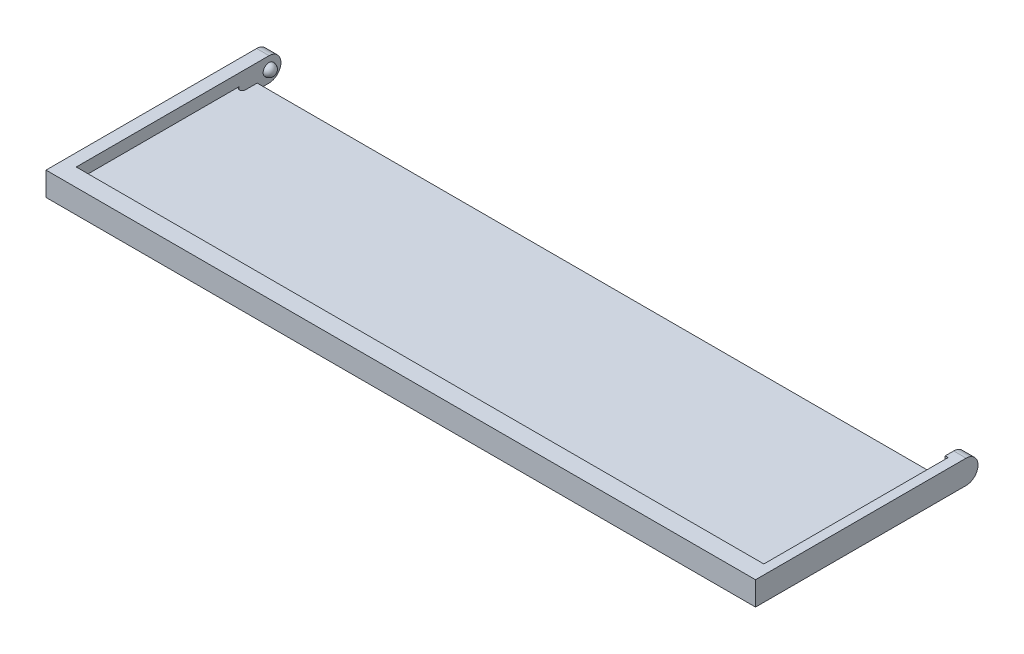
ISO-10303-21;
HEADER;
FILE_DESCRIPTION(('STEP AP214'),'2;1');
FILE_NAME('part.step','',(''),(''),'','','');
FILE_SCHEMA(('AUTOMOTIVE_DESIGN { 1 0 10303 214 1 1 1 1 }'));
ENDSEC;
DATA;
#1=APPLICATION_CONTEXT('core data for automotive mechanical design processes');
#2=APPLICATION_PROTOCOL_DEFINITION('international standard','automotive_design',2000,#1);
#3=PRODUCT_CONTEXT('',#1,'mechanical');
#4=PRODUCT('Part','Part','',(#3));
#5=PRODUCT_RELATED_PRODUCT_CATEGORY('part','',(#4));
#6=PRODUCT_DEFINITION_FORMATION('','',#4);
#7=PRODUCT_DEFINITION_CONTEXT('part definition',#1,'design');
#8=PRODUCT_DEFINITION('design','',#6,#7);
#9=PRODUCT_DEFINITION_SHAPE('','',#8);
#10=(LENGTH_UNIT() NAMED_UNIT(*) SI_UNIT(.MILLI.,.METRE.));
#11=(NAMED_UNIT(*) PLANE_ANGLE_UNIT() SI_UNIT($,.RADIAN.));
#12=(NAMED_UNIT(*) SI_UNIT($,.STERADIAN.) SOLID_ANGLE_UNIT());
#13=UNCERTAINTY_MEASURE_WITH_UNIT(LENGTH_MEASURE(1.E-05),#10,'distance_accuracy_value','');
#14=(GEOMETRIC_REPRESENTATION_CONTEXT(3) GLOBAL_UNCERTAINTY_ASSIGNED_CONTEXT((#13)) GLOBAL_UNIT_ASSIGNED_CONTEXT((#10,
#11,#12)) REPRESENTATION_CONTEXT('',''));
#15=CARTESIAN_POINT('',(0.,0.,0.));
#16=DIRECTION('',(0.,0.,1.));
#17=DIRECTION('',(1.,0.,0.));
#18=AXIS2_PLACEMENT_3D('',#15,#16,#17);
#19=CARTESIAN_POINT('',(49.31605633386,-6.,-26.0544436152008));
#20=DIRECTION('',(0.,1.,0.));
#21=DIRECTION('',(0.,0.,1.));
#22=AXIS2_PLACEMENT_3D('',#19,#20,#21);
#23=CYLINDRICAL_SURFACE('',#22,0.500000000000004);
#24=CARTESIAN_POINT('',(49.31605633386,2.,-26.0544436152008));
#25=DIRECTION('',(0.,1.,0.));
#26=DIRECTION('',(0.,0.,1.));
#27=AXIS2_PLACEMENT_3D('',#24,#25,#26);
#28=CIRCLE('',#27,0.500000000000004);
#29=CARTESIAN_POINT('',(49.81605633386,2.,-26.0544436152008));
#30=VERTEX_POINT('',#29);
#31=CARTESIAN_POINT('',(48.81605633386,2.,-26.0544436152008));
#32=VERTEX_POINT('',#31);
#33=EDGE_CURVE('E224',#30,#32,#28,.F.);
#34=ORIENTED_EDGE('',*,*,#33,.F.);
#35=DIRECTION('',(0.,1.,0.));
#36=VECTOR('',#35,1.);
#37=CARTESIAN_POINT('',(49.81605633386,-6.,-26.0544436152008));
#38=LINE('',#37,#36);
#39=CARTESIAN_POINT('',(49.81605633386,0.,-26.0544436152008));
#40=VERTEX_POINT('',#39);
#41=EDGE_CURVE('E235',#40,#30,#38,.T.);
#42=ORIENTED_EDGE('',*,*,#41,.F.);
#43=CARTESIAN_POINT('',(49.31605633386,0.,-26.0544436152008));
#44=DIRECTION('',(0.,-1.,0.));
#45=DIRECTION('',(0.,0.,-1.));
#46=AXIS2_PLACEMENT_3D('',#43,#44,#45);
#47=CIRCLE('',#46,0.500000000000004);
#48=CARTESIAN_POINT('',(48.81605633386,0.,-26.0544436152008));
#49=VERTEX_POINT('',#48);
#50=EDGE_CURVE('E314',#40,#49,#47,.T.);
#51=ORIENTED_EDGE('',*,*,#50,.T.);
#52=DIRECTION('',(0.,1.,0.));
#53=VECTOR('',#52,1.);
#54=CARTESIAN_POINT('',(48.81605633386,-6.,-26.0544436152008));
#55=LINE('',#54,#53);
#56=EDGE_CURVE('E240',#49,#32,#55,.T.);
#57=ORIENTED_EDGE('',*,*,#56,.T.);
#58=EDGE_LOOP('',(#34,#42,#51,#57));
#59=FACE_BOUND('',#58,.T.);
#60=ADVANCED_FACE('F43',(#59),#23,.F.);
#61=CARTESIAN_POINT('',(48.81605633386,-6.,0.));
#62=DIRECTION('',(-1.,0.,0.));
#63=DIRECTION('',(0.,0.,1.));
#64=AXIS2_PLACEMENT_3D('',#61,#62,#63);
#65=PLANE('',#64);
#66=DIRECTION('',(0.,0.,-1.));
#67=VECTOR('',#66,1.);
#68=CARTESIAN_POINT('',(48.81605633386,2.,0.));
#69=LINE('',#68,#67);
#70=CARTESIAN_POINT('',(48.81605633386,2.,-28.0544436152008));
#71=VERTEX_POINT('',#70);
#72=EDGE_CURVE('E221',#32,#71,#69,.T.);
#73=ORIENTED_EDGE('',*,*,#72,.F.);
#74=ORIENTED_EDGE('',*,*,#56,.F.);
#75=DIRECTION('',(0.,0.,-1.));
#76=VECTOR('',#75,1.);
#77=CARTESIAN_POINT('',(48.81605633386,0.,0.));
#78=LINE('',#77,#76);
#79=CARTESIAN_POINT('',(48.81605633386,0.,-28.0544436152008));
#80=VERTEX_POINT('',#79);
#81=EDGE_CURVE('E311',#49,#80,#78,.T.);
#82=ORIENTED_EDGE('',*,*,#81,.T.);
#83=DIRECTION('',(0.,1.,0.));
#84=VECTOR('',#83,1.);
#85=CARTESIAN_POINT('',(48.81605633386,-6.,-28.0544436152008));
#86=LINE('',#85,#84);
#87=EDGE_CURVE('E244',#80,#71,#86,.T.);
#88=ORIENTED_EDGE('',*,*,#87,.T.);
#89=EDGE_LOOP('',(#73,#74,#82,#88));
#90=FACE_BOUND('',#89,.T.);
#91=ADVANCED_FACE('F386',(#90),#65,.F.);
#92=CARTESIAN_POINT('',(0.,-6.,-28.0544436152008));
#93=DIRECTION('',(0.,0.,1.));
#94=DIRECTION('',(1.,0.,0.));
#95=AXIS2_PLACEMENT_3D('',#92,#93,#94);
#96=PLANE('',#95);
#97=DIRECTION('',(-1.,0.,0.));
#98=VECTOR('',#97,1.);
#99=CARTESIAN_POINT('',(0.,2.,-28.0544436152008));
#100=LINE('',#99,#98);
#101=CARTESIAN_POINT('',(-64.58394366614,2.,-28.0544436152008));
#102=VERTEX_POINT('',#101);
#103=EDGE_CURVE('E218',#71,#102,#100,.T.);
#104=ORIENTED_EDGE('',*,*,#103,.F.);
#105=ORIENTED_EDGE('',*,*,#87,.F.);
#106=DIRECTION('',(-1.,0.,0.));
#107=VECTOR('',#106,1.);
#108=CARTESIAN_POINT('',(0.,0.,-28.0544436152008));
#109=LINE('',#108,#107);
#110=CARTESIAN_POINT('',(-64.58394366614,0.,-28.0544436152008));
#111=VERTEX_POINT('',#110);
#112=EDGE_CURVE('E308',#80,#111,#109,.T.);
#113=ORIENTED_EDGE('',*,*,#112,.T.);
#114=DIRECTION('',(0.,1.,0.));
#115=VECTOR('',#114,1.);
#116=CARTESIAN_POINT('',(-64.58394366614,-6.,-28.0544436152008));
#117=LINE('',#116,#115);
#118=EDGE_CURVE('E248',#111,#102,#117,.T.);
#119=ORIENTED_EDGE('',*,*,#118,.T.);
#120=EDGE_LOOP('',(#104,#105,#113,#119));
#121=FACE_BOUND('',#120,.T.);
#122=ADVANCED_FACE('F392',(#121),#96,.F.);
#123=CARTESIAN_POINT('',(-64.5839436661399,-6.,2.24070566497633E-13));
#124=DIRECTION('',(-1.,0.,0.));
#125=DIRECTION('',(0.,0.,1.));
#126=AXIS2_PLACEMENT_3D('',#123,#124,#125);
#127=PLANE('',#126);
#128=DIRECTION('',(0.,1.,0.));
#129=VECTOR('',#128,1.);
#130=CARTESIAN_POINT('',(-64.58394366614,-6.,-26.0544436152008));
#131=LINE('',#130,#129);
#132=CARTESIAN_POINT('',(-64.58394366614,0.,-26.0544436152008));
#133=VERTEX_POINT('',#132);
#134=CARTESIAN_POINT('',(-64.58394366614,2.,-26.0544436152008));
#135=VERTEX_POINT('',#134);
#136=EDGE_CURVE('E252',#133,#135,#131,.T.);
#137=ORIENTED_EDGE('',*,*,#136,.T.);
#138=DIRECTION('',(0.,0.,-1.));
#139=VECTOR('',#138,1.);
#140=CARTESIAN_POINT('',(-64.5839436661399,2.,2.24070566497633E-13));
#141=LINE('',#140,#139);
#142=EDGE_CURVE('E58',#135,#102,#141,.T.);
#143=ORIENTED_EDGE('',*,*,#142,.T.);
#144=ORIENTED_EDGE('',*,*,#118,.F.);
#145=DIRECTION('',(0.,0.,-1.));
#146=VECTOR('',#145,1.);
#147=CARTESIAN_POINT('',(-64.5839436661399,0.,2.24070566497633E-13));
#148=LINE('',#147,#146);
#149=EDGE_CURVE('E304',#133,#111,#148,.T.);
#150=ORIENTED_EDGE('',*,*,#149,.F.);
#151=EDGE_LOOP('',(#137,#143,#144,#150));
#152=FACE_BOUND('',#151,.T.);
#153=ADVANCED_FACE('F399',(#152),#127,.T.);
#154=CARTESIAN_POINT('',(-65.08394366614,-6.,-26.0544436152008));
#155=DIRECTION('',(0.,1.,0.));
#156=DIRECTION('',(0.,0.,1.));
#157=AXIS2_PLACEMENT_3D('',#154,#155,#156);
#158=CYLINDRICAL_SURFACE('',#157,0.500000000000007);
#159=CARTESIAN_POINT('',(-65.08394366614,2.,-26.0544436152008));
#160=DIRECTION('',(0.,1.,0.));
#161=DIRECTION('',(0.,0.,1.));
#162=AXIS2_PLACEMENT_3D('',#159,#160,#161);
#163=CIRCLE('',#162,0.500000000000007);
#164=CARTESIAN_POINT('',(-65.58394366614,2.,-26.0544436152008));
#165=VERTEX_POINT('',#164);
#166=EDGE_CURVE('E11',#135,#165,#163,.F.);
#167=ORIENTED_EDGE('',*,*,#166,.F.);
#168=ORIENTED_EDGE('',*,*,#136,.F.);
#169=CARTESIAN_POINT('',(-65.08394366614,0.,-26.0544436152008));
#170=DIRECTION('',(0.,-1.,0.));
#171=DIRECTION('',(0.,0.,-1.));
#172=AXIS2_PLACEMENT_3D('',#169,#170,#171);
#173=CIRCLE('',#172,0.500000000000007);
#174=CARTESIAN_POINT('',(-65.58394366614,0.,-26.0544436152008));
#175=VERTEX_POINT('',#174);
#176=EDGE_CURVE('E300',#133,#175,#173,.T.);
#177=ORIENTED_EDGE('',*,*,#176,.T.);
#178=DIRECTION('',(0.,1.,0.));
#179=VECTOR('',#178,1.);
#180=CARTESIAN_POINT('',(-65.58394366614,-6.,-26.0544436152008));
#181=LINE('',#180,#179);
#182=EDGE_CURVE('E256',#175,#165,#181,.T.);
#183=ORIENTED_EDGE('',*,*,#182,.T.);
#184=EDGE_LOOP('',(#167,#168,#177,#183));
#185=FACE_BOUND('',#184,.T.);
#186=ADVANCED_FACE('F403',(#185),#158,.F.);
#187=CARTESIAN_POINT('',(0.,4.,0.));
#188=DIRECTION('',(0.,-1.,0.));
#189=DIRECTION('',(0.,0.,-1.));
#190=AXIS2_PLACEMENT_3D('',#187,#188,#189);
#191=PLANE('',#190);
#192=DIRECTION('',(1.,0.,0.));
#193=VECTOR('',#192,1.);
#194=CARTESIAN_POINT('',(-65.58394366614,4.,1.44555638479922));
#195=LINE('',#194,#193);
#196=CARTESIAN_POINT('',(-65.58394366614,4.,1.44555638479922));
#197=VERTEX_POINT('',#196);
#198=CARTESIAN_POINT('',(50.31605633386,4.,1.44555638479922));
#199=VERTEX_POINT('',#198);
#200=EDGE_CURVE('E202',#197,#199,#195,.T.);
#201=ORIENTED_EDGE('',*,*,#200,.F.);
#202=DIRECTION('',(0.,0.,-1.));
#203=VECTOR('',#202,1.);
#204=CARTESIAN_POINT('',(-65.58394366614,4.,-30.0544436152008));
#205=LINE('',#204,#203);
#206=CARTESIAN_POINT('',(-65.58394366614,4.,-31.0544436152008));
#207=VERTEX_POINT('',#206);
#208=EDGE_CURVE('E183',#197,#207,#205,.T.);
#209=ORIENTED_EDGE('',*,*,#208,.T.);
#210=DIRECTION('',(-1.,0.,0.));
#211=VECTOR('',#210,1.);
#212=CARTESIAN_POINT('',(0.,4.,-31.0544436152008));
#213=LINE('',#212,#211);
#214=CARTESIAN_POINT('',(-67.68394366614,4.,-31.0544436152008));
#215=VERTEX_POINT('',#214);
#216=EDGE_CURVE('E340',#207,#215,#213,.T.);
#217=ORIENTED_EDGE('',*,*,#216,.T.);
#218=DIRECTION('',(0.,0.,1.));
#219=VECTOR('',#218,1.);
#220=CARTESIAN_POINT('',(-67.68394366614,4.,-30.0544436152008));
#221=LINE('',#220,#219);
#222=CARTESIAN_POINT('',(-67.68394366614,4.,4.44555638479922));
#223=VERTEX_POINT('',#222);
#224=EDGE_CURVE('E260',#215,#223,#221,.T.);
#225=ORIENTED_EDGE('',*,*,#224,.T.);
#226=DIRECTION('',(1.,0.,0.));
#227=VECTOR('',#226,1.);
#228=CARTESIAN_POINT('',(-67.68394366614,4.,4.44555638479922));
#229=LINE('',#228,#227);
#230=CARTESIAN_POINT('',(51.91605633386,4.,4.44555638479922));
#231=VERTEX_POINT('',#230);
#232=EDGE_CURVE('E263',#223,#231,#229,.T.);
#233=ORIENTED_EDGE('',*,*,#232,.T.);
#234=DIRECTION('',(0.,0.,-1.));
#235=VECTOR('',#234,1.);
#236=CARTESIAN_POINT('',(51.91605633386,4.,-30.0544436152008));
#237=LINE('',#236,#235);
#238=CARTESIAN_POINT('',(51.91605633386,4.,-31.0544436152008));
#239=VERTEX_POINT('',#238);
#240=EDGE_CURVE('E267',#231,#239,#237,.T.);
#241=ORIENTED_EDGE('',*,*,#240,.T.);
#242=DIRECTION('',(-1.,0.,0.));
#243=VECTOR('',#242,1.);
#244=CARTESIAN_POINT('',(0.,4.,-31.0544436152008));
#245=LINE('',#244,#243);
#246=CARTESIAN_POINT('',(49.81605633386,4.,-31.0544436152008));
#247=VERTEX_POINT('',#246);
#248=EDGE_CURVE('E337',#239,#247,#245,.T.);
#249=ORIENTED_EDGE('',*,*,#248,.T.);
#250=DIRECTION('',(0.,0.,1.));
#251=VECTOR('',#250,1.);
#252=CARTESIAN_POINT('',(49.81605633386,4.,-30.0544436152008));
#253=LINE('',#252,#251);
#254=CARTESIAN_POINT('',(49.81605633386,4.,-29.6257113306572));
#255=VERTEX_POINT('',#254);
#256=EDGE_CURVE('E271',#247,#255,#253,.T.);
#257=ORIENTED_EDGE('',*,*,#256,.T.);
#258=DIRECTION('',(-1.,0.,0.));
#259=VECTOR('',#258,1.);
#260=CARTESIAN_POINT('',(-65.58394366614,4.,-29.6257113306572));
#261=LINE('',#260,#259);
#262=CARTESIAN_POINT('',(50.31605633386,4.,-29.6257113306572));
#263=VERTEX_POINT('',#262);
#264=EDGE_CURVE('E177',#263,#255,#261,.T.);
#265=ORIENTED_EDGE('',*,*,#264,.F.);
#266=DIRECTION('',(0.,0.,-1.));
#267=VECTOR('',#266,1.);
#268=CARTESIAN_POINT('',(50.31605633386,4.,-29.6257113306572));
#269=LINE('',#268,#267);
#270=EDGE_CURVE('E205',#199,#263,#269,.T.);
#271=ORIENTED_EDGE('',*,*,#270,.F.);
#272=EDGE_LOOP('',(#201,#209,#217,#225,#233,#241,#249,#257,#265,#271));
#273=FACE_BOUND('',#272,.T.);
#274=ADVANCED_FACE('F407',(#273),#191,.F.);
#275=CARTESIAN_POINT('',(0.,0.,0.));
#276=DIRECTION('',(0.,-1.,0.));
#277=DIRECTION('',(0.,0.,-1.));
#278=AXIS2_PLACEMENT_3D('',#275,#276,#277);
#279=PLANE('',#278);
#280=DIRECTION('',(0.,0.,1.));
#281=VECTOR('',#280,1.);
#282=CARTESIAN_POINT('',(-67.68394366614,0.,-30.0544436152008));
#283=LINE('',#282,#281);
#284=CARTESIAN_POINT('',(-67.68394366614,0.,-31.0544436152008));
#285=VERTEX_POINT('',#284);
#286=CARTESIAN_POINT('',(-67.68394366614,0.,4.44555638479922));
#287=VERTEX_POINT('',#286);
#288=EDGE_CURVE('E239',#285,#287,#283,.T.);
#289=ORIENTED_EDGE('',*,*,#288,.F.);
#290=DIRECTION('',(-1.,0.,0.));
#291=VECTOR('',#290,1.);
#292=CARTESIAN_POINT('',(-65.58394366614,0.,-31.0544436152008));
#293=LINE('',#292,#291);
#294=CARTESIAN_POINT('',(-65.58394366614,0.,-31.0544436152008));
#295=VERTEX_POINT('',#294);
#296=EDGE_CURVE('E327',#285,#295,#293,.F.);
#297=ORIENTED_EDGE('',*,*,#296,.T.);
#298=DIRECTION('',(0.,0.,-1.));
#299=VECTOR('',#298,1.);
#300=CARTESIAN_POINT('',(-65.58394366614,0.,-30.0544436152008));
#301=LINE('',#300,#299);
#302=EDGE_CURVE('E264',#175,#295,#301,.T.);
#303=ORIENTED_EDGE('',*,*,#302,.F.);
#304=ORIENTED_EDGE('',*,*,#176,.F.);
#305=ORIENTED_EDGE('',*,*,#149,.T.);
#306=ORIENTED_EDGE('',*,*,#112,.F.);
#307=ORIENTED_EDGE('',*,*,#81,.F.);
#308=ORIENTED_EDGE('',*,*,#50,.F.);
#309=DIRECTION('',(0.,0.,1.));
#310=VECTOR('',#309,1.);
#311=CARTESIAN_POINT('',(49.81605633386,0.,-30.0544436152008));
#312=LINE('',#311,#310);
#313=CARTESIAN_POINT('',(49.81605633386,0.,-31.0544436152008));
#314=VERTEX_POINT('',#313);
#315=EDGE_CURVE('E287',#314,#40,#312,.T.);
#316=ORIENTED_EDGE('',*,*,#315,.F.);
#317=DIRECTION('',(-1.,0.,0.));
#318=VECTOR('',#317,1.);
#319=CARTESIAN_POINT('',(51.91605633386,0.,-31.0544436152008));
#320=LINE('',#319,#318);
#321=CARTESIAN_POINT('',(51.91605633386,0.,-31.0544436152008));
#322=VERTEX_POINT('',#321);
#323=EDGE_CURVE('E323',#314,#322,#320,.F.);
#324=ORIENTED_EDGE('',*,*,#323,.T.);
#325=DIRECTION('',(0.,0.,-1.));
#326=VECTOR('',#325,1.);
#327=CARTESIAN_POINT('',(51.91605633386,0.,-30.0544436152008));
#328=LINE('',#327,#326);
#329=CARTESIAN_POINT('',(51.91605633386,0.,4.44555638479922));
#330=VERTEX_POINT('',#329);
#331=EDGE_CURVE('E284',#330,#322,#328,.T.);
#332=ORIENTED_EDGE('',*,*,#331,.F.);
#333=DIRECTION('',(1.,0.,0.));
#334=VECTOR('',#333,1.);
#335=CARTESIAN_POINT('',(-67.68394366614,0.,4.44555638479922));
#336=LINE('',#335,#334);
#337=EDGE_CURVE('E280',#287,#330,#336,.T.);
#338=ORIENTED_EDGE('',*,*,#337,.F.);
#339=EDGE_LOOP('',(#289,#297,#303,#304,#305,#306,#307,#308,#316,#324,#332,#338));
#340=FACE_BOUND('',#339,.T.);
#341=ADVANCED_FACE('F411',(#340),#279,.T.);
#342=CARTESIAN_POINT('',(-67.68394366614,4.,-30.0544436152008));
#343=DIRECTION('',(1.,0.,0.));
#344=DIRECTION('',(0.,0.,-1.));
#345=AXIS2_PLACEMENT_3D('',#342,#343,#344);
#346=PLANE('',#345);
#347=CARTESIAN_POINT('',(-67.68394366614,2.,-31.0544436152008));
#348=DIRECTION('',(1.,0.,0.));
#349=DIRECTION('',(0.,0.,-1.));
#350=AXIS2_PLACEMENT_3D('',#347,#348,#349);
#351=CIRCLE('',#350,2.);
#352=CARTESIAN_POINT('',(-67.68394366614,2.,-33.0544436152008));
#353=VERTEX_POINT('',#352);
#354=EDGE_CURVE('E317',#215,#353,#351,.F.);
#355=ORIENTED_EDGE('',*,*,#354,.T.);
#356=CARTESIAN_POINT('',(-67.68394366614,2.,-31.0544436152008));
#357=DIRECTION('',(1.,0.,0.));
#358=DIRECTION('',(0.,0.,-1.));
#359=AXIS2_PLACEMENT_3D('',#356,#357,#358);
#360=CIRCLE('',#359,2.);
#361=EDGE_CURVE('E320',#353,#285,#360,.F.);
#362=ORIENTED_EDGE('',*,*,#361,.T.);
#363=ORIENTED_EDGE('',*,*,#288,.T.);
#364=DIRECTION('',(0.,-1.,0.));
#365=VECTOR('',#364,1.);
#366=CARTESIAN_POINT('',(-67.68394366614,4.,4.44555638479922));
#367=LINE('',#366,#365);
#368=EDGE_CURVE('E296',#223,#287,#367,.T.);
#369=ORIENTED_EDGE('',*,*,#368,.F.);
#370=ORIENTED_EDGE('',*,*,#224,.F.);
#371=EDGE_LOOP('',(#355,#362,#363,#369,#370));
#372=FACE_BOUND('',#371,.T.);
#373=ADVANCED_FACE('F415',(#372),#346,.F.);
#374=CARTESIAN_POINT('',(-67.68394366614,4.,4.44555638479922));
#375=DIRECTION('',(0.,0.,-1.));
#376=DIRECTION('',(-1.,0.,0.));
#377=AXIS2_PLACEMENT_3D('',#374,#375,#376);
#378=PLANE('',#377);
#379=ORIENTED_EDGE('',*,*,#337,.T.);
#380=DIRECTION('',(0.,-1.,0.));
#381=VECTOR('',#380,1.);
#382=CARTESIAN_POINT('',(51.91605633386,4.,4.44555638479922));
#383=LINE('',#382,#381);
#384=EDGE_CURVE('E277',#231,#330,#383,.T.);
#385=ORIENTED_EDGE('',*,*,#384,.F.);
#386=ORIENTED_EDGE('',*,*,#232,.F.);
#387=ORIENTED_EDGE('',*,*,#368,.T.);
#388=EDGE_LOOP('',(#379,#385,#386,#387));
#389=FACE_BOUND('',#388,.T.);
#390=ADVANCED_FACE('F426',(#389),#378,.F.);
#391=CARTESIAN_POINT('',(51.91605633386,4.,-30.0544436152008));
#392=DIRECTION('',(-1.,0.,0.));
#393=DIRECTION('',(0.,0.,1.));
#394=AXIS2_PLACEMENT_3D('',#391,#392,#393);
#395=PLANE('',#394);
#396=ORIENTED_EDGE('',*,*,#331,.T.);
#397=CARTESIAN_POINT('',(51.91605633386,2.,-31.0544436152008));
#398=DIRECTION('',(-1.,0.,0.));
#399=DIRECTION('',(0.,0.,1.));
#400=AXIS2_PLACEMENT_3D('',#397,#398,#399);
#401=CIRCLE('',#400,2.);
#402=CARTESIAN_POINT('',(51.91605633386,2.,-33.0544436152008));
#403=VERTEX_POINT('',#402);
#404=EDGE_CURVE('E66',#322,#403,#401,.F.);
#405=ORIENTED_EDGE('',*,*,#404,.T.);
#406=CARTESIAN_POINT('',(51.91605633386,2.,-31.0544436152008));
#407=DIRECTION('',(-1.,0.,0.));
#408=DIRECTION('',(0.,0.,1.));
#409=AXIS2_PLACEMENT_3D('',#406,#407,#408);
#410=CIRCLE('',#409,2.);
#411=EDGE_CURVE('E349',#403,#239,#410,.F.);
#412=ORIENTED_EDGE('',*,*,#411,.T.);
#413=ORIENTED_EDGE('',*,*,#240,.F.);
#414=ORIENTED_EDGE('',*,*,#384,.T.);
#415=EDGE_LOOP('',(#396,#405,#412,#413,#414));
#416=FACE_BOUND('',#415,.T.);
#417=ADVANCED_FACE('F423',(#416),#395,.F.);
#418=CARTESIAN_POINT('',(49.81605633386,4.,-30.0544436152008));
#419=DIRECTION('',(1.,0.,0.));
#420=DIRECTION('',(0.,0.,-1.));
#421=AXIS2_PLACEMENT_3D('',#418,#419,#420);
#422=PLANE('',#421);
#423=CARTESIAN_POINT('',(49.81605633386,2.,-31.0544436152008));
#424=DIRECTION('',(1.,0.,0.));
#425=DIRECTION('',(0.,0.,-1.));
#426=AXIS2_PLACEMENT_3D('',#423,#424,#425);
#427=CIRCLE('',#426,1.);
#428=CARTESIAN_POINT('',(49.81605633386,2.,-32.0544436152008));
#429=VERTEX_POINT('',#428);
#430=EDGE_CURVE('E234',#429,#429,#427,.T.);
#431=ORIENTED_EDGE('',*,*,#430,.T.);
#432=EDGE_LOOP('',(#431));
#433=FACE_BOUND('',#432,.T.);
#434=DIRECTION('',(0.,0.,1.));
#435=VECTOR('',#434,1.);
#436=CARTESIAN_POINT('',(49.81605633386,2.,-30.0544436152008));
#437=LINE('',#436,#435);
#438=CARTESIAN_POINT('',(49.81605633386,2.,-29.6257113306572));
#439=VERTEX_POINT('',#438);
#440=EDGE_CURVE('E227',#439,#30,#437,.T.);
#441=ORIENTED_EDGE('',*,*,#440,.F.);
#442=DIRECTION('',(0.,1.,0.));
#443=VECTOR('',#442,1.);
#444=CARTESIAN_POINT('',(49.81605633386,4.,-29.6257113306572));
#445=LINE('',#444,#443);
#446=EDGE_CURVE('E230',#439,#255,#445,.T.);
#447=ORIENTED_EDGE('',*,*,#446,.T.);
#448=ORIENTED_EDGE('',*,*,#256,.F.);
#449=CARTESIAN_POINT('',(49.81605633386,2.,-31.0544436152008));
#450=DIRECTION('',(1.,0.,0.));
#451=DIRECTION('',(0.,0.,-1.));
#452=AXIS2_PLACEMENT_3D('',#449,#450,#451);
#453=CIRCLE('',#452,2.);
#454=CARTESIAN_POINT('',(49.81605633386,2.,-33.0544436152008));
#455=VERTEX_POINT('',#454);
#456=EDGE_CURVE('E343',#247,#455,#453,.F.);
#457=ORIENTED_EDGE('',*,*,#456,.T.);
#458=CARTESIAN_POINT('',(49.81605633386,2.,-31.0544436152008));
#459=DIRECTION('',(1.,0.,0.));
#460=DIRECTION('',(0.,0.,-1.));
#461=AXIS2_PLACEMENT_3D('',#458,#459,#460);
#462=CIRCLE('',#461,2.);
#463=EDGE_CURVE('E346',#455,#314,#462,.F.);
#464=ORIENTED_EDGE('',*,*,#463,.T.);
#465=ORIENTED_EDGE('',*,*,#315,.T.);
#466=ORIENTED_EDGE('',*,*,#41,.T.);
#467=EDGE_LOOP('',(#441,#447,#448,#457,#464,#465,#466));
#468=FACE_BOUND('',#467,.T.);
#469=ADVANCED_FACE('F367',(#433,#468),#422,.F.);
#470=CARTESIAN_POINT('',(-65.58394366614,4.,-30.0544436152008));
#471=DIRECTION('',(-1.,0.,0.));
#472=DIRECTION('',(0.,0.,1.));
#473=AXIS2_PLACEMENT_3D('',#470,#471,#472);
#474=PLANE('',#473);
#475=CARTESIAN_POINT('',(-65.58394366614,2.,-31.0544436152008));
#476=DIRECTION('',(-1.,0.,0.));
#477=DIRECTION('',(0.,0.,1.));
#478=AXIS2_PLACEMENT_3D('',#475,#476,#477);
#479=CIRCLE('',#478,1.);
#480=CARTESIAN_POINT('',(-65.58394366614,2.,-30.0544436152008));
#481=VERTEX_POINT('',#480);
#482=EDGE_CURVE('E52',#481,#481,#479,.F.);
#483=ORIENTED_EDGE('',*,*,#482,.F.);
#484=EDGE_LOOP('',(#483));
#485=FACE_BOUND('',#484,.T.);
#486=CARTESIAN_POINT('',(-65.58394366614,2.,-31.0544436152008));
#487=DIRECTION('',(-1.,0.,0.));
#488=DIRECTION('',(0.,0.,1.));
#489=AXIS2_PLACEMENT_3D('',#486,#487,#488);
#490=CIRCLE('',#489,2.);
#491=CARTESIAN_POINT('',(-65.58394366614,2.,-33.0544436152008));
#492=VERTEX_POINT('',#491);
#493=EDGE_CURVE('E331',#492,#207,#490,.F.);
#494=ORIENTED_EDGE('',*,*,#493,.T.);
#495=ORIENTED_EDGE('',*,*,#208,.F.);
#496=DIRECTION('',(0.,1.,0.));
#497=VECTOR('',#496,1.);
#498=CARTESIAN_POINT('',(-65.58394366614,2.,1.44555638479922));
#499=LINE('',#498,#497);
#500=CARTESIAN_POINT('',(-65.58394366614,2.,1.44555638479922));
#501=VERTEX_POINT('',#500);
#502=EDGE_CURVE('E180',#501,#197,#499,.T.);
#503=ORIENTED_EDGE('',*,*,#502,.F.);
#504=DIRECTION('',(0.,0.,1.));
#505=VECTOR('',#504,1.);
#506=CARTESIAN_POINT('',(-65.58394366614,2.,-29.6257113306572));
#507=LINE('',#506,#505);
#508=EDGE_CURVE('E167',#165,#501,#507,.T.);
#509=ORIENTED_EDGE('',*,*,#508,.F.);
#510=ORIENTED_EDGE('',*,*,#182,.F.);
#511=ORIENTED_EDGE('',*,*,#302,.T.);
#512=CARTESIAN_POINT('',(-65.58394366614,2.,-31.0544436152008));
#513=DIRECTION('',(-1.,0.,0.));
#514=DIRECTION('',(0.,0.,1.));
#515=AXIS2_PLACEMENT_3D('',#512,#513,#514);
#516=CIRCLE('',#515,2.);
#517=EDGE_CURVE('E334',#295,#492,#516,.F.);
#518=ORIENTED_EDGE('',*,*,#517,.T.);
#519=EDGE_LOOP('',(#494,#495,#503,#509,#510,#511,#518));
#520=FACE_BOUND('',#519,.T.);
#521=ADVANCED_FACE('F182',(#485,#520),#474,.F.);
#522=CARTESIAN_POINT('',(0.,2.,-31.0544436152008));
#523=DIRECTION('',(-1.,0.,0.));
#524=DIRECTION('',(0.,0.,1.));
#525=AXIS2_PLACEMENT_3D('',#522,#523,#524);
#526=CYLINDRICAL_SURFACE('',#525,2.);
#527=ORIENTED_EDGE('',*,*,#216,.F.);
#528=ORIENTED_EDGE('',*,*,#493,.F.);
#529=DIRECTION('',(-1.,0.,0.));
#530=VECTOR('',#529,1.);
#531=CARTESIAN_POINT('',(-67.68394366614,2.,-33.0544436152008));
#532=LINE('',#531,#530);
#533=EDGE_CURVE('E259',#353,#492,#532,.F.);
#534=ORIENTED_EDGE('',*,*,#533,.F.);
#535=ORIENTED_EDGE('',*,*,#354,.F.);
#536=EDGE_LOOP('',(#527,#528,#534,#535));
#537=FACE_BOUND('',#536,.T.);
#538=ADVANCED_FACE('F419',(#537),#526,.T.);
#539=CARTESIAN_POINT('',(-67.68394366614,2.,-31.0544436152008));
#540=DIRECTION('',(1.,0.,0.));
#541=DIRECTION('',(0.,0.,-1.));
#542=AXIS2_PLACEMENT_3D('',#539,#540,#541);
#543=CYLINDRICAL_SURFACE('',#542,2.);
#544=ORIENTED_EDGE('',*,*,#517,.F.);
#545=ORIENTED_EDGE('',*,*,#296,.F.);
#546=ORIENTED_EDGE('',*,*,#361,.F.);
#547=ORIENTED_EDGE('',*,*,#533,.T.);
#548=EDGE_LOOP('',(#544,#545,#546,#547));
#549=FACE_BOUND('',#548,.T.);
#550=ADVANCED_FACE('F433',(#549),#543,.T.);
#551=CARTESIAN_POINT('',(0.,2.,-31.0544436152008));
#552=DIRECTION('',(-1.,0.,0.));
#553=DIRECTION('',(0.,0.,1.));
#554=AXIS2_PLACEMENT_3D('',#551,#552,#553);
#555=CYLINDRICAL_SURFACE('',#554,2.);
#556=ORIENTED_EDGE('',*,*,#248,.F.);
#557=ORIENTED_EDGE('',*,*,#411,.F.);
#558=DIRECTION('',(-1.,0.,0.));
#559=VECTOR('',#558,1.);
#560=CARTESIAN_POINT('',(51.91605633386,2.,-33.0544436152008));
#561=LINE('',#560,#559);
#562=EDGE_CURVE('E357',#455,#403,#561,.F.);
#563=ORIENTED_EDGE('',*,*,#562,.F.);
#564=ORIENTED_EDGE('',*,*,#456,.F.);
#565=EDGE_LOOP('',(#556,#557,#563,#564));
#566=FACE_BOUND('',#565,.T.);
#567=ADVANCED_FACE('F45',(#566),#555,.T.);
#568=CARTESIAN_POINT('',(51.91605633386,2.,-31.0544436152008));
#569=DIRECTION('',(1.,0.,0.));
#570=DIRECTION('',(0.,0.,-1.));
#571=AXIS2_PLACEMENT_3D('',#568,#569,#570);
#572=CYLINDRICAL_SURFACE('',#571,2.);
#573=ORIENTED_EDGE('',*,*,#404,.F.);
#574=ORIENTED_EDGE('',*,*,#323,.F.);
#575=ORIENTED_EDGE('',*,*,#463,.F.);
#576=ORIENTED_EDGE('',*,*,#562,.T.);
#577=EDGE_LOOP('',(#573,#574,#575,#576));
#578=FACE_BOUND('',#577,.T.);
#579=ADVANCED_FACE('F381',(#578),#572,.T.);
#580=CARTESIAN_POINT('',(-65.58394366614,2.,-31.0544436152008));
#581=DIRECTION('',(0.,0.,-1.));
#582=DIRECTION('',(0.,-1.,0.));
#583=AXIS2_PLACEMENT_3D('',#580,#581,#582);
#584=SPHERICAL_SURFACE('',#583,1.);
#585=CARTESIAN_POINT('',(-65.58394366614,2.,-31.0544436152008));
#586=DIRECTION('',(-1.,0.,0.));
#587=DIRECTION('',(0.,0.,1.));
#588=AXIS2_PLACEMENT_3D('',#585,#586,#587);
#589=SPHERICAL_SURFACE('',#588,1.);
#590=ORIENTED_EDGE('',*,*,#482,.T.);
#591=EDGE_LOOP('',(#590));
#592=FACE_BOUND('',#591,.T.);
#593=ADVANCED_FACE('F373',(#592),#589,.T.);
#594=CARTESIAN_POINT('',(49.8160563338601,2.,-31.0544436152008));
#595=DIRECTION('',(0.,0.,-1.));
#596=DIRECTION('',(0.,-1.,0.));
#597=AXIS2_PLACEMENT_3D('',#594,#595,#596);
#598=SPHERICAL_SURFACE('',#597,1.);
#599=CARTESIAN_POINT('',(49.8160563338601,2.,-31.0544436152008));
#600=DIRECTION('',(1.,0.,0.));
#601=DIRECTION('',(0.,0.,-1.));
#602=AXIS2_PLACEMENT_3D('',#599,#600,#601);
#603=SPHERICAL_SURFACE('',#602,1.);
#604=ORIENTED_EDGE('',*,*,#430,.F.);
#605=EDGE_LOOP('',(#604));
#606=FACE_BOUND('',#605,.T.);
#607=ADVANCED_FACE('F370',(#606),#603,.T.);
#608=CARTESIAN_POINT('',(-65.58394366614,2.,-29.6257113306572));
#609=DIRECTION('',(0.,0.,-1.));
#610=DIRECTION('',(-1.,0.,0.));
#611=AXIS2_PLACEMENT_3D('',#608,#609,#610);
#612=PLANE('',#611);
#613=DIRECTION('',(-1.,0.,0.));
#614=VECTOR('',#613,1.);
#615=CARTESIAN_POINT('',(-65.58394366614,2.,-29.6257113306572));
#616=LINE('',#615,#614);
#617=CARTESIAN_POINT('',(50.31605633386,2.,-29.6257113306572));
#618=VERTEX_POINT('',#617);
#619=EDGE_CURVE('E189',#618,#439,#616,.T.);
#620=ORIENTED_EDGE('',*,*,#619,.F.);
#621=DIRECTION('',(0.,1.,0.));
#622=VECTOR('',#621,1.);
#623=CARTESIAN_POINT('',(50.31605633386,2.,-29.6257113306572));
#624=LINE('',#623,#622);
#625=EDGE_CURVE('E211',#618,#263,#624,.T.);
#626=ORIENTED_EDGE('',*,*,#625,.T.);
#627=ORIENTED_EDGE('',*,*,#264,.T.);
#628=ORIENTED_EDGE('',*,*,#446,.F.);
#629=EDGE_LOOP('',(#620,#626,#627,#628));
#630=FACE_BOUND('',#629,.T.);
#631=ADVANCED_FACE('F372',(#630),#612,.F.);
#632=CARTESIAN_POINT('',(0.,2.,0.));
#633=DIRECTION('',(0.,1.,0.));
#634=DIRECTION('',(0.,0.,1.));
#635=AXIS2_PLACEMENT_3D('',#632,#633,#634);
#636=PLANE('',#635);
#637=ORIENTED_EDGE('',*,*,#440,.T.);
#638=ORIENTED_EDGE('',*,*,#33,.T.);
#639=ORIENTED_EDGE('',*,*,#72,.T.);
#640=ORIENTED_EDGE('',*,*,#103,.T.);
#641=ORIENTED_EDGE('',*,*,#142,.F.);
#642=ORIENTED_EDGE('',*,*,#166,.T.);
#643=ORIENTED_EDGE('',*,*,#508,.T.);
#644=DIRECTION('',(1.,0.,0.));
#645=VECTOR('',#644,1.);
#646=CARTESIAN_POINT('',(-65.58394366614,2.,1.44555638479922));
#647=LINE('',#646,#645);
#648=CARTESIAN_POINT('',(50.31605633386,2.,1.44555638479922));
#649=VERTEX_POINT('',#648);
#650=EDGE_CURVE('E172',#501,#649,#647,.T.);
#651=ORIENTED_EDGE('',*,*,#650,.T.);
#652=DIRECTION('',(0.,0.,-1.));
#653=VECTOR('',#652,1.);
#654=CARTESIAN_POINT('',(50.31605633386,2.,-29.6257113306572));
#655=LINE('',#654,#653);
#656=EDGE_CURVE('E194',#649,#618,#655,.T.);
#657=ORIENTED_EDGE('',*,*,#656,.T.);
#658=ORIENTED_EDGE('',*,*,#619,.T.);
#659=EDGE_LOOP('',(#637,#638,#639,#640,#641,#642,#643,#651,#657,#658));
#660=FACE_BOUND('',#659,.T.);
#661=ADVANCED_FACE('F169',(#660),#636,.T.);
#662=CARTESIAN_POINT('',(50.31605633386,2.,-29.6257113306572));
#663=DIRECTION('',(1.,0.,0.));
#664=DIRECTION('',(0.,0.,-1.));
#665=AXIS2_PLACEMENT_3D('',#662,#663,#664);
#666=PLANE('',#665);
#667=ORIENTED_EDGE('',*,*,#270,.T.);
#668=ORIENTED_EDGE('',*,*,#625,.F.);
#669=ORIENTED_EDGE('',*,*,#656,.F.);
#670=DIRECTION('',(0.,1.,0.));
#671=VECTOR('',#670,1.);
#672=CARTESIAN_POINT('',(50.31605633386,2.,1.44555638479922));
#673=LINE('',#672,#671);
#674=EDGE_CURVE('E188',#649,#199,#673,.T.);
#675=ORIENTED_EDGE('',*,*,#674,.T.);
#676=EDGE_LOOP('',(#667,#668,#669,#675));
#677=FACE_BOUND('',#676,.T.);
#678=ADVANCED_FACE('F466',(#677),#666,.F.);
#679=CARTESIAN_POINT('',(-65.58394366614,2.,1.44555638479922));
#680=DIRECTION('',(0.,0.,1.));
#681=DIRECTION('',(1.,0.,0.));
#682=AXIS2_PLACEMENT_3D('',#679,#680,#681);
#683=PLANE('',#682);
#684=ORIENTED_EDGE('',*,*,#200,.T.);
#685=ORIENTED_EDGE('',*,*,#674,.F.);
#686=ORIENTED_EDGE('',*,*,#650,.F.);
#687=ORIENTED_EDGE('',*,*,#502,.T.);
#688=EDGE_LOOP('',(#684,#685,#686,#687));
#689=FACE_BOUND('',#688,.T.);
#690=ADVANCED_FACE('F191',(#689),#683,.F.);
#691=CLOSED_SHELL('',(#60,#91,#122,#153,#186,#274,#341,#373,#390,#417,#469,#521,#538,#550,#567,
#579,#593,#607,#631,#661,#678,#690));
#692=MANIFOLD_SOLID_BREP('B2',#691);
#693=ADVANCED_BREP_SHAPE_REPRESENTATION('',(#18,#692),#14);
#694=SHAPE_DEFINITION_REPRESENTATION(#9,#693);
ENDSEC;
END-ISO-10303-21;
